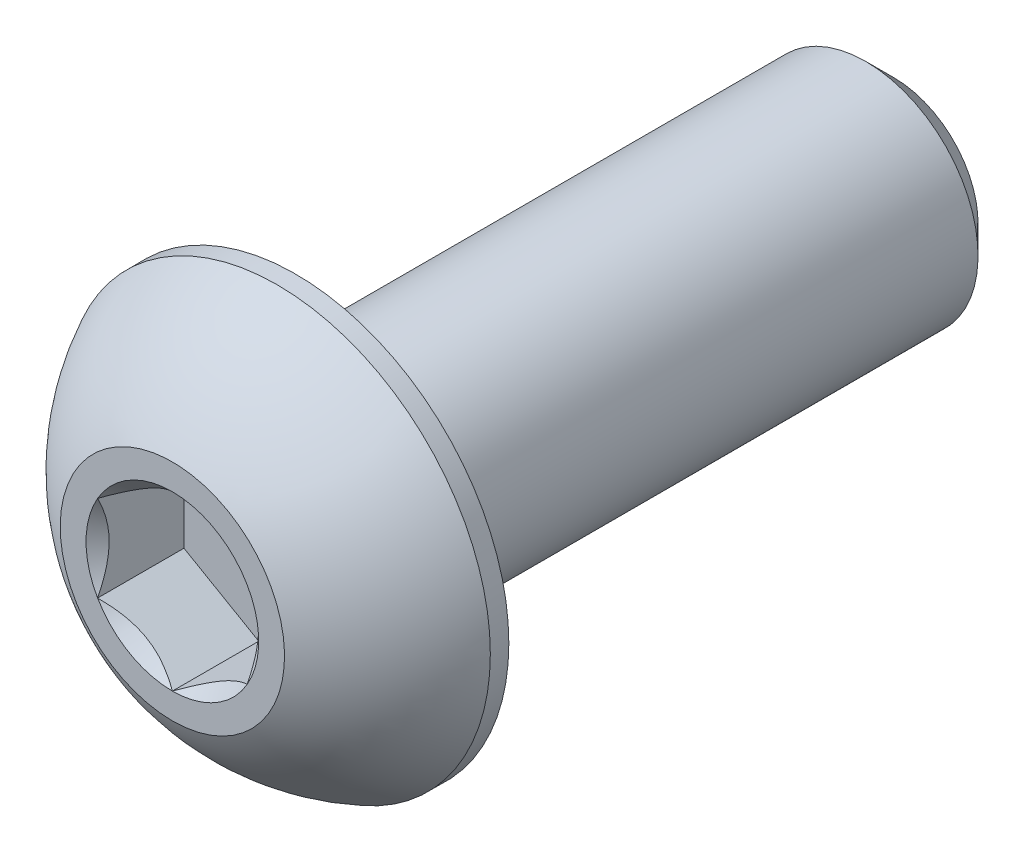
ISO-10303-21;
HEADER;
FILE_DESCRIPTION(('STEP AP214'),'2;1');
FILE_NAME('part.step','',(''),(''),'','','');
FILE_SCHEMA(('AUTOMOTIVE_DESIGN { 1 0 10303 214 1 1 1 1 }'));
ENDSEC;
DATA;
#1=APPLICATION_CONTEXT('core data for automotive mechanical design processes');
#2=APPLICATION_PROTOCOL_DEFINITION('international standard','automotive_design',2000,#1);
#3=PRODUCT_CONTEXT('',#1,'mechanical');
#4=PRODUCT('Part','Part','',(#3));
#5=PRODUCT_RELATED_PRODUCT_CATEGORY('part','',(#4));
#6=PRODUCT_DEFINITION_FORMATION('','',#4);
#7=PRODUCT_DEFINITION_CONTEXT('part definition',#1,'design');
#8=PRODUCT_DEFINITION('design','',#6,#7);
#9=PRODUCT_DEFINITION_SHAPE('','',#8);
#10=(LENGTH_UNIT() NAMED_UNIT(*) SI_UNIT(.MILLI.,.METRE.));
#11=(NAMED_UNIT(*) PLANE_ANGLE_UNIT() SI_UNIT($,.RADIAN.));
#12=(NAMED_UNIT(*) SI_UNIT($,.STERADIAN.) SOLID_ANGLE_UNIT());
#13=UNCERTAINTY_MEASURE_WITH_UNIT(LENGTH_MEASURE(1.E-05),#10,'distance_accuracy_value','');
#14=(GEOMETRIC_REPRESENTATION_CONTEXT(3) GLOBAL_UNCERTAINTY_ASSIGNED_CONTEXT((#13)) GLOBAL_UNIT_ASSIGNED_CONTEXT((#10,
#11,#12)) REPRESENTATION_CONTEXT('',''));
#15=CARTESIAN_POINT('',(0.,0.,0.));
#16=DIRECTION('',(0.,0.,1.));
#17=DIRECTION('',(1.,0.,0.));
#18=AXIS2_PLACEMENT_3D('',#15,#16,#17);
#19=CARTESIAN_POINT('',(0.,-1.5,-9.65));
#20=DIRECTION('',(0.,0.,-1.));
#21=DIRECTION('',(0.,1.,0.));
#22=AXIS2_PLACEMENT_3D('',#19,#20,#21);
#23=PLANE('',#22);
#24=CARTESIAN_POINT('',(0.,0.,-9.65));
#25=DIRECTION('',(0.,0.,-1.));
#26=DIRECTION('',(0.,1.,0.));
#27=AXIS2_PLACEMENT_3D('',#24,#25,#26);
#28=CIRCLE('',#27,1.125);
#29=CARTESIAN_POINT('',(0.,1.125,-9.65));
#30=VERTEX_POINT('',#29);
#31=EDGE_CURVE('E174',#30,#30,#28,.T.);
#32=ORIENTED_EDGE('',*,*,#31,.T.);
#33=EDGE_LOOP('',(#32));
#34=FACE_BOUND('',#33,.T.);
#35=ADVANCED_FACE('F35',(#34),#23,.T.);
#36=CARTESIAN_POINT('',(0.,0.,-9.65));
#37=DIRECTION('',(0.,0.,-1.));
#38=DIRECTION('',(0.,1.,0.));
#39=AXIS2_PLACEMENT_3D('',#36,#37,#38);
#40=CYLINDRICAL_SURFACE('',#39,1.5);
#41=CARTESIAN_POINT('',(0.,0.,-9.275));
#42=DIRECTION('',(0.,0.,-1.));
#43=DIRECTION('',(0.,1.,0.));
#44=AXIS2_PLACEMENT_3D('',#41,#42,#43);
#45=CIRCLE('',#44,1.5);
#46=CARTESIAN_POINT('',(0.,1.5,-9.275));
#47=VERTEX_POINT('',#46);
#48=EDGE_CURVE('E48',#47,#47,#45,.F.);
#49=ORIENTED_EDGE('',*,*,#48,.T.);
#50=EDGE_LOOP('',(#49));
#51=FACE_BOUND('',#50,.T.);
#52=CARTESIAN_POINT('',(0.,0.,-1.65));
#53=DIRECTION('',(0.,0.,1.));
#54=DIRECTION('',(1.,0.,0.));
#55=AXIS2_PLACEMENT_3D('',#52,#53,#54);
#56=CIRCLE('',#55,1.5);
#57=CARTESIAN_POINT('',(1.5,0.,-1.65));
#58=VERTEX_POINT('',#57);
#59=EDGE_CURVE('E171',#58,#58,#56,.F.);
#60=ORIENTED_EDGE('',*,*,#59,.T.);
#61=EDGE_LOOP('',(#60));
#62=FACE_BOUND('',#61,.T.);
#63=ADVANCED_FACE('F179',(#51,#62),#40,.T.);
#64=CARTESIAN_POINT('',(0.,0.,-9.65));
#65=DIRECTION('',(0.,0.,1.));
#66=DIRECTION('',(0.,-1.,0.));
#67=AXIS2_PLACEMENT_3D('',#64,#65,#66);
#68=CONICAL_SURFACE('',#67,1.125,0.785398163397444);
#69=ORIENTED_EDGE('',*,*,#48,.F.);
#70=EDGE_LOOP('',(#69));
#71=FACE_BOUND('',#70,.T.);
#72=ORIENTED_EDGE('',*,*,#31,.F.);
#73=EDGE_LOOP('',(#72));
#74=FACE_BOUND('',#73,.T.);
#75=ADVANCED_FACE('F37',(#71,#74),#68,.T.);
#76=CARTESIAN_POINT('',(0.,0.,-2.79483288770053));
#77=DIRECTION('',(0.,0.,1.));
#78=DIRECTION('',(0.,-1.,0.));
#79=AXIS2_PLACEMENT_3D('',#76,#77,#78);
#80=SPHERICAL_SURFACE('',#79,3.17192226735973);
#81=CARTESIAN_POINT('',(0.,0.,0.));
#82=DIRECTION('',(0.,0.,1.));
#83=DIRECTION('',(1.,0.,0.));
#84=AXIS2_PLACEMENT_3D('',#81,#82,#83);
#85=CIRCLE('',#84,1.5);
#86=CARTESIAN_POINT('',(0.,-1.5,0.));
#87=VERTEX_POINT('',#86);
#88=EDGE_CURVE('E168',#87,#87,#85,.T.);
#89=CARTESIAN_POINT('',(0.,0.,-1.4025));
#90=DIRECTION('',(0.,0.,1.));
#91=DIRECTION('',(1.,0.,0.));
#92=AXIS2_PLACEMENT_3D('',#89,#90,#91);
#93=CIRCLE('',#92,2.85);
#94=CARTESIAN_POINT('',(0.,-2.85,-1.4025));
#95=VERTEX_POINT('',#94);
#96=EDGE_CURVE('E162',#95,#95,#93,.T.);
#97=CARTESIAN_POINT('',(0.,-1.5,0.));
#98=CARTESIAN_POINT('',(0.,-1.5181600798921,-0.00974656947336528));
#99=CARTESIAN_POINT('',(0.,-1.53622513742981,-0.0196701847238475));
#100=CARTESIAN_POINT('',(0.,-1.57215840256594,-0.0398676311293121));
#101=CARTESIAN_POINT('',(0.,-1.59002661016438,-0.0501414622842944));
#102=CARTESIAN_POINT('',(0.,-1.6255593701915,-0.0710354648490241));
#103=CARTESIAN_POINT('',(0.,-1.64322392262019,-0.0816556362587714));
#104=CARTESIAN_POINT('',(0.,-1.67834266450262,-0.103238276426967));
#105=CARTESIAN_POINT('',(0.,-1.69579685395636,-0.114200745185416));
#106=CARTESIAN_POINT('',(0.,-1.73048823664554,-0.136463816635606));
#107=CARTESIAN_POINT('',(0.,-1.74772542988099,-0.147764419327347));
#108=CARTESIAN_POINT('',(0.,-1.78197627078176,-0.170699464187153));
#109=CARTESIAN_POINT('',(0.,-1.79898991844709,-0.182333906355219));
#110=CARTESIAN_POINT('',(0.,-1.83278720341135,-0.205932209546912));
#111=CARTESIAN_POINT('',(0.,-1.84957084071028,-0.21789607057054));
#112=CARTESIAN_POINT('',(0.,-1.88290172764636,-0.242148665498754));
#113=CARTESIAN_POINT('',(0.,-1.89944897728351,-0.254437399403341));
#114=CARTESIAN_POINT('',(0.,-1.93230080139369,-0.279335070725423));
#115=CARTESIAN_POINT('',(0.,-1.94860537586673,-0.291944008142919));
#116=CARTESIAN_POINT('',(0.,-1.98096565436365,-0.317477295441111));
#117=CARTESIAN_POINT('',(0.,-1.99702135838753,-0.330401645321807));
#118=CARTESIAN_POINT('',(0.,-2.02887779526297,-0.356560846652225));
#119=CARTESIAN_POINT('',(0.,-2.04467852811452,-0.369795698101948));
#120=CARTESIAN_POINT('',(0.,-2.07601901880464,-0.396570873693307));
#121=CARTESIAN_POINT('',(0.,-2.09155877664321,-0.410111197834942));
#122=CARTESIAN_POINT('',(0.,-2.12237141262985,-0.437492173862106));
#123=CARTESIAN_POINT('',(0.,-2.13764429077792,-0.451332825747633));
#124=CARTESIAN_POINT('',(0.,-2.16791736411296,-0.479309198198268));
#125=CARTESIAN_POINT('',(0.,-2.18291755929993,-0.493444918763374));
#126=CARTESIAN_POINT('',(0.,-2.21263956705415,-0.52200605739095));
#127=CARTESIAN_POINT('',(0.,-2.22736137962139,-0.536431475453418));
#128=CARTESIAN_POINT('',(0.,-2.2565210282552,-0.56556652781647));
#129=CARTESIAN_POINT('',(0.,-2.27095886432178,-0.580276162117054));
#130=CARTESIAN_POINT('',(0.,-2.2995450739765,-0.609974057702794));
#131=CARTESIAN_POINT('',(0.,-2.31369344756465,-0.624962318987951));
#132=CARTESIAN_POINT('',(0.,-2.34169535627252,-0.655211773418758));
#133=CARTESIAN_POINT('',(0.,-2.35554889139224,-0.670472966564409));
#134=CARTESIAN_POINT('',(0.,-2.38295585920366,-0.701262485885582));
#135=CARTESIAN_POINT('',(0.,-2.39650929189537,-0.716790812061104));
#136=CARTESIAN_POINT('',(0.,-2.42331090492182,-0.748108697108241));
#137=CARTESIAN_POINT('',(0.,-2.43655908525656,-0.763898255979857));
#138=CARTESIAN_POINT('',(0.,-2.46274515962755,-0.795732606824226));
#139=CARTESIAN_POINT('',(0.,-2.47568305366379,-0.811777398796979));
#140=CARTESIAN_POINT('',(0.,-2.50124363939651,-0.844116119267125));
#141=CARTESIAN_POINT('',(0.,-2.51386633109298,-0.860410047764518));
#142=CARTESIAN_POINT('',(0.,-2.53879171587278,-0.893240850042598));
#143=CARTESIAN_POINT('',(0.,-2.55109440895612,-0.909777723823286));
#144=CARTESIAN_POINT('',(0.,-2.57537512182785,-0.943088133113639));
#145=CARTESIAN_POINT('',(0.,-2.58735314161625,-0.959861668623304));
#146=CARTESIAN_POINT('',(0.,-2.61097995657956,-0.993639027894245));
#147=CARTESIAN_POINT('',(0.,-2.62262875175448,-1.01064285165552));
#148=CARTESIAN_POINT('',(0.,-2.64559269128198,-1.04487432644225));
#149=CARTESIAN_POINT('',(0.,-2.65690783563458,-1.06210197746771));
#150=CARTESIAN_POINT('',(0.,-2.67920017403639,-1.09677456077299));
#151=CARTESIAN_POINT('',(0.,-2.69017736808561,-1.11421949305282));
#152=CARTESIAN_POINT('',(0.,-2.711789634999,-1.14932001019995));
#153=CARTESIAN_POINT('',(0.,-2.72242470786316,-1.16697559506725));
#154=CARTESIAN_POINT('',(0.,-2.74334869082118,-1.20249070903942));
#155=CARTESIAN_POINT('',(0.,-2.75363760091502,-1.22035023814429));
#156=CARTESIAN_POINT('',(0.,-2.77386535089241,-1.25626645340824));
#157=CARTESIAN_POINT('',(0.,-2.78380419077596,-1.27432313956732));
#158=CARTESIAN_POINT('',(0.,-2.80332801615778,-1.31062681184411));
#159=CARTESIAN_POINT('',(0.,-2.81291300165605,-1.32887379796182));
#160=CARTESIAN_POINT('',(0.,-2.83172550494215,-1.3655511220839));
#161=CARTESIAN_POINT('',(0.,-2.84095302272998,-1.38398146008827));
#162=CARTESIAN_POINT('',(0.,-2.85,-1.4025));
#163=B_SPLINE_CURVE_WITH_KNOTS('',3,(#97,#98,#99,#100,#101,#102,#103,#104,#105,#106,#107,#108,
#109,#110,#111,#112,#113,#114,#115,#116,#117,#118,#119,#120,#121,#122,#123,#124,#125,#126,#127,
#128,#129,#130,#131,#132,#133,#134,#135,#136,#137,#138,#139,#140,#141,#142,#143,#144,#145,#146,
#147,#148,#149,#150,#151,#152,#153,#154,#155,#156,#157,#158,#159,#160,#161,#162),.UNSPECIFIED.,
.F.,.F.,(4,2,2,2,2,2,2,2,2,2,2,2,2,2,2,2,2,2,2,2,2,2,2,2,2,2,2,2,2,2,2,2,4),(0.,
0.0618298941826979,0.123659788365397,0.185489682548095,0.247319576730792,0.309149470913491,
0.370979365096189,0.432809259278888,0.494639153461586,0.556469047644284,0.618298941826982,
0.68012883600968,0.741958730192378,0.803788624375077,0.865618518557775,0.927448412740473,
0.989278306923171,1.05110820110587,1.11293809528857,1.17476798947127,1.23659788365396,
1.29842777783666,1.36025767201936,1.42208756620206,1.48391746038476,1.54574735456745,
1.60757724875015,1.66940714293285,1.73123703711555,1.79306693129825,1.85489682548095,
1.91672671966364,1.97855661384634),.UNSPECIFIED.);
#164=EDGE_CURVE('BSEAM184',#87,#95,#163,.T.);
#165=ORIENTED_EDGE('',*,*,#88,.F.);
#166=ORIENTED_EDGE('',*,*,#96,.T.);
#167=ORIENTED_EDGE('',*,*,#164,.T.);
#168=ORIENTED_EDGE('',*,*,#164,.F.);
#169=EDGE_LOOP('',(#165,#167,#166,#168));
#170=FACE_BOUND('',#169,.T.);
#171=ADVANCED_FACE('F184',(#170),#80,.T.);
#172=CARTESIAN_POINT('',(0.,-1.5,0.));
#173=DIRECTION('',(0.,0.,-1.));
#174=DIRECTION('',(-1.,0.,0.));
#175=AXIS2_PLACEMENT_3D('',#172,#173,#174);
#176=PLANE('',#175);
#177=CARTESIAN_POINT('',(0.,0.,0.));
#178=DIRECTION('',(0.,0.,1.));
#179=DIRECTION('',(1.,0.,0.));
#180=AXIS2_PLACEMENT_3D('',#177,#178,#179);
#181=CIRCLE('',#180,1.15470053837925);
#182=CARTESIAN_POINT('',(-1.,0.577350269189626,0.));
#183=VERTEX_POINT('',#182);
#184=CARTESIAN_POINT('',(-1.,-0.577350269189626,0.));
#185=VERTEX_POINT('',#184);
#186=EDGE_CURVE('E61',#183,#185,#181,.T.);
#187=ORIENTED_EDGE('',*,*,#186,.F.);
#188=CARTESIAN_POINT('',(0.,1.15470053837925,0.));
#189=VERTEX_POINT('',#188);
#190=EDGE_CURVE('E133',#189,#183,#181,.T.);
#191=ORIENTED_EDGE('',*,*,#190,.F.);
#192=CARTESIAN_POINT('',(1.,0.577350269189626,0.));
#193=VERTEX_POINT('',#192);
#194=EDGE_CURVE('E130',#193,#189,#181,.T.);
#195=ORIENTED_EDGE('',*,*,#194,.F.);
#196=CARTESIAN_POINT('',(1.,-0.577350269189626,0.));
#197=VERTEX_POINT('',#196);
#198=EDGE_CURVE('E101',#197,#193,#181,.T.);
#199=ORIENTED_EDGE('',*,*,#198,.F.);
#200=CARTESIAN_POINT('',(0.,-1.15470053837925,0.));
#201=VERTEX_POINT('',#200);
#202=EDGE_CURVE('E93',#201,#197,#181,.T.);
#203=ORIENTED_EDGE('',*,*,#202,.F.);
#204=EDGE_CURVE('E54',#185,#201,#181,.T.);
#205=ORIENTED_EDGE('',*,*,#204,.F.);
#206=EDGE_LOOP('',(#187,#191,#195,#199,#203,#205));
#207=FACE_BOUND('',#206,.T.);
#208=ORIENTED_EDGE('',*,*,#88,.T.);
#209=EDGE_LOOP('',(#208));
#210=FACE_BOUND('',#209,.T.);
#211=ADVANCED_FACE('F127',(#207,#210),#176,.F.);
#212=CARTESIAN_POINT('',(0.,-2.85,-1.65));
#213=DIRECTION('',(0.,0.,1.));
#214=DIRECTION('',(1.,0.,0.));
#215=AXIS2_PLACEMENT_3D('',#212,#213,#214);
#216=PLANE('',#215);
#217=ORIENTED_EDGE('',*,*,#59,.F.);
#218=EDGE_LOOP('',(#217));
#219=FACE_BOUND('',#218,.T.);
#220=CARTESIAN_POINT('',(0.,0.,-1.65));
#221=DIRECTION('',(0.,0.,1.));
#222=DIRECTION('',(1.,0.,0.));
#223=AXIS2_PLACEMENT_3D('',#220,#221,#222);
#224=CIRCLE('',#223,2.85);
#225=CARTESIAN_POINT('',(2.85,0.,-1.65));
#226=VERTEX_POINT('',#225);
#227=EDGE_CURVE('E165',#226,#226,#224,.T.);
#228=ORIENTED_EDGE('',*,*,#227,.F.);
#229=EDGE_LOOP('',(#228));
#230=FACE_BOUND('',#229,.T.);
#231=ADVANCED_FACE('F198',(#219,#230),#216,.F.);
#232=CARTESIAN_POINT('',(0.,0.,0.));
#233=DIRECTION('',(0.,0.,1.));
#234=DIRECTION('',(1.,0.,0.));
#235=AXIS2_PLACEMENT_3D('',#232,#233,#234);
#236=CYLINDRICAL_SURFACE('',#235,2.85);
#237=ORIENTED_EDGE('',*,*,#96,.F.);
#238=EDGE_LOOP('',(#237));
#239=FACE_BOUND('',#238,.T.);
#240=ORIENTED_EDGE('',*,*,#227,.T.);
#241=EDGE_LOOP('',(#240));
#242=FACE_BOUND('',#241,.T.);
#243=ADVANCED_FACE('F201',(#239,#242),#236,.T.);
#244=CARTESIAN_POINT('',(0.,0.,0.));
#245=DIRECTION('',(0.,0.,1.));
#246=DIRECTION('',(1.,0.,0.));
#247=AXIS2_PLACEMENT_3D('',#244,#245,#246);
#248=CONICAL_SURFACE('',#247,1.15470053837925,0.78539816339745);
#249=ORIENTED_EDGE('',*,*,#198,.T.);
#250=CARTESIAN_POINT('',(1.,-1.15147208646462,0.37038567751386));
#251=CARTESIAN_POINT('',(1.,-1.12343447988552,0.349219919873711));
#252=CARTESIAN_POINT('',(1.,-1.09524064850697,0.328261692175909));
#253=CARTESIAN_POINT('',(1.,-1.03847715644376,0.28684602223562));
#254=CARTESIAN_POINT('',(1.,-1.00990740382975,0.266388706123658));
#255=CARTESIAN_POINT('',(1.,-0.923120894333476,0.205604794954508));
#256=CARTESIAN_POINT('',(1.,-0.864253173759059,0.166192228961397));
#257=CARTESIAN_POINT('',(1.,-0.740809858258045,0.0888206642002041));
#258=CARTESIAN_POINT('',(1.,-0.676100255137807,0.0510730391143413));
#259=CARTESIAN_POINT('',(1.,-0.543448939049124,-0.0179754124487091));
#260=CARTESIAN_POINT('',(1.,-0.475519112027778,-0.0492979721531354));
#261=CARTESIAN_POINT('',(1.,-0.373555850333528,-0.0876182211162059));
#262=CARTESIAN_POINT('',(1.,-0.341031989670907,-0.0986164083578445));
#263=CARTESIAN_POINT('',(1.,-0.275199079052293,-0.11800165785264));
#264=CARTESIAN_POINT('',(1.,-0.241889975173933,-0.126388540223302));
#265=CARTESIAN_POINT('',(1.,-0.175247517042992,-0.139974779280984));
#266=CARTESIAN_POINT('',(1.,-0.141925568218174,-0.145229209232033));
#267=CARTESIAN_POINT('',(1.,-0.0749144362322786,-0.152451313429108));
#268=CARTESIAN_POINT('',(1.,-0.0412251978501615,-0.154418486389493));
#269=CARTESIAN_POINT('',(1.,0.0249580992634212,-0.15491680160684));
#270=CARTESIAN_POINT('',(1.,0.0574512826460394,-0.153569732111366));
#271=CARTESIAN_POINT('',(1.,0.122148505701867,-0.147783515501016));
#272=CARTESIAN_POINT('',(1.,0.154352610132927,-0.143345079338465));
#273=CARTESIAN_POINT('',(1.,0.21879989886764,-0.131543169854797));
#274=CARTESIAN_POINT('',(1.,0.251033743268954,-0.124129458961492));
#275=CARTESIAN_POINT('',(1.,0.314797132354919,-0.106771057501325));
#276=CARTESIAN_POINT('',(1.,0.346326735731005,-0.096826578711171));
#277=CARTESIAN_POINT('',(1.,0.445594187730205,-0.061776517445664));
#278=CARTESIAN_POINT('',(1.,0.511919139476037,-0.0326791416432762));
#279=CARTESIAN_POINT('',(1.,0.641453244657532,0.032015329686504));
#280=CARTESIAN_POINT('',(1.,0.704650133126344,0.0676357767152409));
#281=CARTESIAN_POINT('',(1.,0.825428490174987,0.141123901346934));
#282=CARTESIAN_POINT('',(1.,0.883132947867685,0.178791947135463));
#283=CARTESIAN_POINT('',(1.,0.968148853704565,0.237022852943162));
#284=CARTESIAN_POINT('',(1.,0.996120570380285,0.256638475762855));
#285=CARTESIAN_POINT('',(1.,1.05168177729901,0.29638851706127));
#286=CARTESIAN_POINT('',(1.,1.079271369977,0.316522792198831));
#287=CARTESIAN_POINT('',(1.,1.10670185346329,0.336872119072971));
#288=B_SPLINE_CURVE_WITH_KNOTS('',3,(#250,#251,#252,#253,#254,#255,#256,#257,#258,#259,#260,
#261,#262,#263,#264,#265,#266,#267,#268,#269,#270,#271,#272,#273,#274,#275,#276,#277,#278,#279,
#280,#281,#282,#283,#284,#285,#286,#287),.UNSPECIFIED.,.F.,.F.,(4,2,2,2,2,2,2,2,2,2,2,2,2,2,2,2,
2,2,4),(0.,0.105386459083291,0.210799187330124,0.423233611565468,0.647793540908503,
0.871580877738609,0.97449307418142,1.07741235827201,1.17846428203205,1.27953161415762,
1.3769408673961,1.47432772585408,1.57343322804293,1.67253043972851,1.88917353996827,
2.10660791038813,2.31323734249843,2.41572589232044,2.51818641476503),.UNSPECIFIED.);
#289=EDGE_CURVE('E11',#197,#193,#288,.T.);
#290=ORIENTED_EDGE('',*,*,#289,.F.);
#291=EDGE_LOOP('',(#249,#290));
#292=FACE_BOUND('',#291,.T.);
#293=ADVANCED_FACE('F105',(#292),#248,.F.);
#294=ORIENTED_EDGE('',*,*,#194,.T.);
#295=CARTESIAN_POINT('',(1.0002,0.577234799135788,0.00011548737261379));
#296=CARTESIAN_POINT('',(0.965817404992819,0.597085599618622,-0.0197220691742672));
#297=CARTESIAN_POINT('',(0.930859881860175,0.617268335009457,-0.0383949793611113));
#298=CARTESIAN_POINT('',(0.85957719704391,0.658423412276686,-0.0725852572768423));
#299=CARTESIAN_POINT('',(0.823245249471016,0.67939967198808,-0.0880835909765416));
#300=CARTESIAN_POINT('',(0.749983386196689,0.721697428470847,-0.114632692857735));
#301=CARTESIAN_POINT('',(0.713072148554586,0.743008141459637,-0.125750226003074));
#302=CARTESIAN_POINT('',(0.638437270689141,0.786098608286186,-0.142880134223818));
#303=CARTESIAN_POINT('',(0.600715911891364,0.807877044942281,-0.148905302533328));
#304=CARTESIAN_POINT('',(0.535707801582067,0.845409494928863,-0.154339445032507));
#305=CARTESIAN_POINT('',(0.508505628471828,0.861114676896602,-0.155143061683268));
#306=CARTESIAN_POINT('',(0.454153959330888,0.892494627706029,-0.153793300583113));
#307=CARTESIAN_POINT('',(0.427004476245124,0.908169389073954,-0.151639270452801));
#308=CARTESIAN_POINT('',(0.34594372267304,0.954969836969511,-0.140883027871529));
#309=CARTESIAN_POINT('',(0.292435859021573,0.985862616452447,-0.127985443584644));
#310=CARTESIAN_POINT('',(0.198523934856568,1.04008269114923,-0.0968592693978228));
#311=CARTESIAN_POINT('',(0.157679476328165,1.06366425027551,-0.0802622022981607));
#312=CARTESIAN_POINT('',(0.0775903626180559,1.1099037216352,-0.0428750753147074));
#313=CARTESIAN_POINT('',(0.0383409891295618,1.1325643579843,-0.0220986581825969));
#314=CARTESIAN_POINT('',(-0.000200000000000448,1.15481600843309,0.000115487372613952));
#315=B_SPLINE_CURVE_WITH_KNOTS('',3,(#295,#296,#297,#298,#299,#300,#301,#302,#303,#304,#305,
#306,#307,#308,#309,#310,#311,#312,#313,#314),.UNSPECIFIED.,.F.,.F.,(4,2,2,2,2,2,2,2,2,4),(0.,
0.133237676828559,0.26725222983449,0.3991370762693,0.530689603280768,0.624814864263846,
0.718960890149133,0.907306626112097,1.05710100361789,1.20641411519286),.UNSPECIFIED.);
#316=EDGE_CURVE('E132',#193,#189,#315,.T.);
#317=ORIENTED_EDGE('',*,*,#316,.F.);
#318=EDGE_LOOP('',(#294,#317));
#319=FACE_BOUND('',#318,.T.);
#320=ADVANCED_FACE('F281',(#319),#248,.F.);
#321=ORIENTED_EDGE('',*,*,#190,.T.);
#322=CARTESIAN_POINT('',(0.000199999999999653,1.15481600843309,0.000115487372613877));
#323=CARTESIAN_POINT('',(-0.034182595007181,1.13496520795026,-0.0197220691742673));
#324=CARTESIAN_POINT('',(-0.0691401181398251,1.11478247255942,-0.0383949793611114));
#325=CARTESIAN_POINT('',(-0.14042280295609,1.07362739529219,-0.0725852572768422));
#326=CARTESIAN_POINT('',(-0.176754750528985,1.0526511355808,-0.0880835909765414));
#327=CARTESIAN_POINT('',(-0.250016613803312,1.01035337909803,-0.114632692857735));
#328=CARTESIAN_POINT('',(-0.286927851445415,0.989042666109241,-0.125750226003074));
#329=CARTESIAN_POINT('',(-0.36156272931086,0.945952199282691,-0.142880134223818));
#330=CARTESIAN_POINT('',(-0.399284088108636,0.924173762626596,-0.148905302533328));
#331=CARTESIAN_POINT('',(-0.464292198417934,0.886641312640014,-0.154339445032506));
#332=CARTESIAN_POINT('',(-0.491494371528172,0.870936130672275,-0.155143061683268));
#333=CARTESIAN_POINT('',(-0.545846040669112,0.839556179862848,-0.153793300583113));
#334=CARTESIAN_POINT('',(-0.572995523754876,0.823881418494923,-0.151639270452801));
#335=CARTESIAN_POINT('',(-0.65405627732696,0.777080970599367,-0.140883027871529));
#336=CARTESIAN_POINT('',(-0.707564140978428,0.74618819111643,-0.127985443584644));
#337=CARTESIAN_POINT('',(-0.801476065143432,0.691968116419649,-0.096859269397823));
#338=CARTESIAN_POINT('',(-0.842320523671834,0.668386557293371,-0.0802622022981609));
#339=CARTESIAN_POINT('',(-0.922409637381944,0.622147085933681,-0.0428750753147075));
#340=CARTESIAN_POINT('',(-0.961659010870438,0.599486449584575,-0.0220986581825969));
#341=CARTESIAN_POINT('',(-1.0002,0.577234799135788,0.000115487372613623));
#342=B_SPLINE_CURVE_WITH_KNOTS('',3,(#322,#323,#324,#325,#326,#327,#328,#329,#330,#331,#332,
#333,#334,#335,#336,#337,#338,#339,#340,#341),.UNSPECIFIED.,.F.,.F.,(4,2,2,2,2,2,2,2,2,4),(0.,
0.133237676828559,0.26725222983449,0.3991370762693,0.530689603280768,0.624814864263846,
0.718960890149133,0.907306626112098,1.05710100361789,1.20641411519286),.UNSPECIFIED.);
#343=EDGE_CURVE('E137',#189,#183,#342,.T.);
#344=ORIENTED_EDGE('',*,*,#343,.F.);
#345=EDGE_LOOP('',(#321,#344));
#346=FACE_BOUND('',#345,.T.);
#347=ADVANCED_FACE('F140',(#346),#248,.F.);
#348=ORIENTED_EDGE('',*,*,#186,.T.);
#349=CARTESIAN_POINT('',(-1.,-1.15147208646462,0.370385677513861));
#350=CARTESIAN_POINT('',(-1.,-1.12343447988552,0.349219919873711));
#351=CARTESIAN_POINT('',(-1.,-1.09524064850697,0.328261692175909));
#352=CARTESIAN_POINT('',(-1.,-1.03847715644376,0.286846022235621));
#353=CARTESIAN_POINT('',(-1.,-1.00990740382975,0.266388706123658));
#354=CARTESIAN_POINT('',(-1.,-0.923120894333477,0.205604794954509));
#355=CARTESIAN_POINT('',(-1.,-0.86425317375906,0.166192228961397));
#356=CARTESIAN_POINT('',(-1.,-0.740809858258046,0.0888206642002046));
#357=CARTESIAN_POINT('',(-1.,-0.676100255137807,0.0510730391143418));
#358=CARTESIAN_POINT('',(-1.,-0.543448939049125,-0.0179754124487088));
#359=CARTESIAN_POINT('',(-1.,-0.475519112027779,-0.0492979721531352));
#360=CARTESIAN_POINT('',(-1.,-0.373555850333529,-0.0876182211162059));
#361=CARTESIAN_POINT('',(-1.,-0.341031989670908,-0.0986164083578445));
#362=CARTESIAN_POINT('',(-1.,-0.275199079052293,-0.11800165785264));
#363=CARTESIAN_POINT('',(-1.,-0.241889975173933,-0.126388540223302));
#364=CARTESIAN_POINT('',(-1.,-0.175247517042993,-0.139974779280984));
#365=CARTESIAN_POINT('',(-1.,-0.141925568218175,-0.145229209232033));
#366=CARTESIAN_POINT('',(-1.,-0.074914436232279,-0.152451313429108));
#367=CARTESIAN_POINT('',(-1.,-0.0412251978501618,-0.154418486389493));
#368=CARTESIAN_POINT('',(-1.,0.0249580992634209,-0.15491680160684));
#369=CARTESIAN_POINT('',(-1.,0.0574512826460391,-0.153569732111367));
#370=CARTESIAN_POINT('',(-1.,0.122148505701867,-0.147783515501016));
#371=CARTESIAN_POINT('',(-1.,0.154352610132926,-0.143345079338465));
#372=CARTESIAN_POINT('',(-1.,0.21879989886764,-0.131543169854797));
#373=CARTESIAN_POINT('',(-1.,0.251033743268953,-0.124129458961492));
#374=CARTESIAN_POINT('',(-1.,0.314797132354919,-0.106771057501325));
#375=CARTESIAN_POINT('',(-1.,0.346326735731004,-0.0968265787111712));
#376=CARTESIAN_POINT('',(-1.,0.445594187730205,-0.0617765174456643));
#377=CARTESIAN_POINT('',(-1.,0.511919139476036,-0.0326791416432765));
#378=CARTESIAN_POINT('',(-1.,0.641453244657531,0.0320153296865035));
#379=CARTESIAN_POINT('',(-1.,0.704650133126343,0.0676357767152402));
#380=CARTESIAN_POINT('',(-1.,0.825428490174986,0.141123901346934));
#381=CARTESIAN_POINT('',(-1.,0.883132947867684,0.178791947135462));
#382=CARTESIAN_POINT('',(-1.,0.968148853704564,0.237022852943162));
#383=CARTESIAN_POINT('',(-1.,0.996120570380284,0.256638475762855));
#384=CARTESIAN_POINT('',(-1.,1.05168177729901,0.296388517061269));
#385=CARTESIAN_POINT('',(-1.,1.079271369977,0.31652279219883));
#386=CARTESIAN_POINT('',(-1.,1.10670185346329,0.33687211907297));
#387=B_SPLINE_CURVE_WITH_KNOTS('',3,(#349,#350,#351,#352,#353,#354,#355,#356,#357,#358,#359,
#360,#361,#362,#363,#364,#365,#366,#367,#368,#369,#370,#371,#372,#373,#374,#375,#376,#377,#378,
#379,#380,#381,#382,#383,#384,#385,#386),.UNSPECIFIED.,.F.,.F.,(4,2,2,2,2,2,2,2,2,2,2,2,2,2,2,2,
2,2,4),(0.,0.105386459083291,0.210799187330125,0.423233611565469,0.647793540908503,
0.87158087773861,0.974493074181421,1.07741235827201,1.17846428203205,1.27953161415762,
1.3769408673961,1.47432772585408,1.57343322804293,1.67253043972851,1.88917353996827,
2.10660791038813,2.31323734249843,2.41572589232044,2.51818641476503),.UNSPECIFIED.);
#388=EDGE_CURVE('E144',#183,#185,#387,.F.);
#389=ORIENTED_EDGE('',*,*,#388,.F.);
#390=EDGE_LOOP('',(#348,#389));
#391=FACE_BOUND('',#390,.T.);
#392=ADVANCED_FACE('F275',(#391),#248,.F.);
#393=ORIENTED_EDGE('',*,*,#204,.T.);
#394=CARTESIAN_POINT('',(-1.0002,-0.577234799135788,0.00011548737261379));
#395=CARTESIAN_POINT('',(-0.965817404992819,-0.597085599618622,-0.0197220691742671));
#396=CARTESIAN_POINT('',(-0.930859881860175,-0.617268335009456,-0.0383949793611112));
#397=CARTESIAN_POINT('',(-0.85957719704391,-0.658423412276686,-0.0725852572768422));
#398=CARTESIAN_POINT('',(-0.823245249471016,-0.67939967198808,-0.0880835909765416));
#399=CARTESIAN_POINT('',(-0.749983386196689,-0.721697428470847,-0.114632692857735));
#400=CARTESIAN_POINT('',(-0.713072148554586,-0.743008141459637,-0.125750226003074));
#401=CARTESIAN_POINT('',(-0.638437270689141,-0.786098608286186,-0.142880134223818));
#402=CARTESIAN_POINT('',(-0.600715911891364,-0.807877044942281,-0.148905302533327));
#403=CARTESIAN_POINT('',(-0.535707801582066,-0.845409494928863,-0.154339445032506));
#404=CARTESIAN_POINT('',(-0.508505628471828,-0.861114676896602,-0.155143061683268));
#405=CARTESIAN_POINT('',(-0.454153959330888,-0.892494627706029,-0.153793300583113));
#406=CARTESIAN_POINT('',(-0.427004476245124,-0.908169389073954,-0.151639270452801));
#407=CARTESIAN_POINT('',(-0.34594372267304,-0.954969836969511,-0.140883027871529));
#408=CARTESIAN_POINT('',(-0.292435859021572,-0.985862616452447,-0.127985443584644));
#409=CARTESIAN_POINT('',(-0.198523934856568,-1.04008269114923,-0.0968592693978226));
#410=CARTESIAN_POINT('',(-0.157679476328166,-1.06366425027551,-0.0802622022981606));
#411=CARTESIAN_POINT('',(-0.0775903626180561,-1.1099037216352,-0.0428750753147073));
#412=CARTESIAN_POINT('',(-0.038340989129562,-1.1325643579843,-0.0220986581825967));
#413=CARTESIAN_POINT('',(0.000200000000000127,-1.15481600843309,0.000115487372614116));
#414=B_SPLINE_CURVE_WITH_KNOTS('',3,(#394,#395,#396,#397,#398,#399,#400,#401,#402,#403,#404,
#405,#406,#407,#408,#409,#410,#411,#412,#413),.UNSPECIFIED.,.F.,.F.,(4,2,2,2,2,2,2,2,2,4),(0.,
0.133237676828559,0.26725222983449,0.3991370762693,0.530689603280768,0.624814864263846,
0.718960890149133,0.907306626112098,1.05710100361789,1.20641411519286),.UNSPECIFIED.);
#415=EDGE_CURVE('E117',#185,#201,#414,.T.);
#416=ORIENTED_EDGE('',*,*,#415,.F.);
#417=EDGE_LOOP('',(#393,#416));
#418=FACE_BOUND('',#417,.T.);
#419=ADVANCED_FACE('F226',(#418),#248,.F.);
#420=ORIENTED_EDGE('',*,*,#202,.T.);
#421=CARTESIAN_POINT('',(-0.000199999999999753,-1.15481600843309,0.000115487372614094));
#422=CARTESIAN_POINT('',(0.0341825950071809,-1.13496520795026,-0.019722069174267));
#423=CARTESIAN_POINT('',(0.0691401181398251,-1.11478247255942,-0.0383949793611112));
#424=CARTESIAN_POINT('',(0.14042280295609,-1.07362739529219,-0.0725852572768422));
#425=CARTESIAN_POINT('',(0.176754750528984,-1.0526511355808,-0.0880835909765414));
#426=CARTESIAN_POINT('',(0.250016613803311,-1.01035337909803,-0.114632692857735));
#427=CARTESIAN_POINT('',(0.286927851445415,-0.989042666109241,-0.125750226003074));
#428=CARTESIAN_POINT('',(0.36156272931086,-0.945952199282691,-0.142880134223818));
#429=CARTESIAN_POINT('',(0.399284088108636,-0.924173762626596,-0.148905302533327));
#430=CARTESIAN_POINT('',(0.464292198417934,-0.886641312640014,-0.154339445032506));
#431=CARTESIAN_POINT('',(0.491494371528173,-0.870936130672275,-0.155143061683268));
#432=CARTESIAN_POINT('',(0.545846040669112,-0.839556179862848,-0.153793300583113));
#433=CARTESIAN_POINT('',(0.572995523754876,-0.823881418494923,-0.151639270452801));
#434=CARTESIAN_POINT('',(0.65405627732696,-0.777080970599366,-0.140883027871529));
#435=CARTESIAN_POINT('',(0.707564140978428,-0.74618819111643,-0.127985443584644));
#436=CARTESIAN_POINT('',(0.801476065143432,-0.691968116419649,-0.0968592693978231));
#437=CARTESIAN_POINT('',(0.842320523671835,-0.668386557293371,-0.0802622022981609));
#438=CARTESIAN_POINT('',(0.922409637381944,-0.622147085933681,-0.0428750753147075));
#439=CARTESIAN_POINT('',(0.961659010870438,-0.599486449584575,-0.022098658182597));
#440=CARTESIAN_POINT('',(1.0002,-0.577234799135788,0.000115487372613542));
#441=B_SPLINE_CURVE_WITH_KNOTS('',3,(#421,#422,#423,#424,#425,#426,#427,#428,#429,#430,#431,
#432,#433,#434,#435,#436,#437,#438,#439,#440),.UNSPECIFIED.,.F.,.F.,(4,2,2,2,2,2,2,2,2,4),(0.,
0.133237676828559,0.26725222983449,0.3991370762693,0.530689603280769,0.624814864263847,
0.718960890149133,0.907306626112098,1.05710100361789,1.20641411519286),.UNSPECIFIED.);
#442=EDGE_CURVE('E97',#201,#197,#441,.T.);
#443=ORIENTED_EDGE('',*,*,#442,.F.);
#444=EDGE_LOOP('',(#420,#443));
#445=FACE_BOUND('',#444,.T.);
#446=ADVANCED_FACE('F95',(#445),#248,.F.);
#447=CARTESIAN_POINT('',(1.,-0.577350269189626,-1.155));
#448=DIRECTION('',(0.,0.,1.));
#449=DIRECTION('',(1.,0.,0.));
#450=AXIS2_PLACEMENT_3D('',#447,#448,#449);
#451=PLANE('',#450);
#452=DIRECTION('',(0.866025403784438,0.500000000000001,0.));
#453=VECTOR('',#452,1.);
#454=CARTESIAN_POINT('',(0.,-1.15470053837925,-1.155));
#455=LINE('',#454,#453);
#456=CARTESIAN_POINT('',(0.,-1.15470053837925,-1.155));
#457=VERTEX_POINT('',#456);
#458=CARTESIAN_POINT('',(1.,-0.577350269189626,-1.155));
#459=VERTEX_POINT('',#458);
#460=EDGE_CURVE('E116',#457,#459,#455,.T.);
#461=ORIENTED_EDGE('',*,*,#460,.T.);
#462=DIRECTION('',(0.,1.,0.));
#463=VECTOR('',#462,1.);
#464=CARTESIAN_POINT('',(1.,-0.577350269189626,-1.155));
#465=LINE('',#464,#463);
#466=CARTESIAN_POINT('',(1.,0.577350269189626,-1.155));
#467=VERTEX_POINT('',#466);
#468=EDGE_CURVE('E121',#459,#467,#465,.T.);
#469=ORIENTED_EDGE('',*,*,#468,.T.);
#470=DIRECTION('',(-0.866025403784439,0.5,0.));
#471=VECTOR('',#470,1.);
#472=CARTESIAN_POINT('',(1.,0.577350269189626,-1.155));
#473=LINE('',#472,#471);
#474=CARTESIAN_POINT('',(0.,1.15470053837925,-1.155));
#475=VERTEX_POINT('',#474);
#476=EDGE_CURVE('E265',#467,#475,#473,.T.);
#477=ORIENTED_EDGE('',*,*,#476,.T.);
#478=DIRECTION('',(-0.866025403784438,-0.5,0.));
#479=VECTOR('',#478,1.);
#480=CARTESIAN_POINT('',(0.,1.15470053837925,-1.155));
#481=LINE('',#480,#479);
#482=CARTESIAN_POINT('',(-1.,0.577350269189626,-1.155));
#483=VERTEX_POINT('',#482);
#484=EDGE_CURVE('E153',#475,#483,#481,.T.);
#485=ORIENTED_EDGE('',*,*,#484,.T.);
#486=DIRECTION('',(0.,-1.,0.));
#487=VECTOR('',#486,1.);
#488=CARTESIAN_POINT('',(-1.,0.577350269189626,-1.155));
#489=LINE('',#488,#487);
#490=CARTESIAN_POINT('',(-1.,-0.577350269189626,-1.155));
#491=VERTEX_POINT('',#490);
#492=EDGE_CURVE('E269',#483,#491,#489,.T.);
#493=ORIENTED_EDGE('',*,*,#492,.T.);
#494=DIRECTION('',(0.866025403784439,-0.5,0.));
#495=VECTOR('',#494,1.);
#496=CARTESIAN_POINT('',(-1.,-0.577350269189626,-1.155));
#497=LINE('',#496,#495);
#498=EDGE_CURVE('E124',#491,#457,#497,.T.);
#499=ORIENTED_EDGE('',*,*,#498,.T.);
#500=EDGE_LOOP('',(#461,#469,#477,#485,#493,#499));
#501=FACE_BOUND('',#500,.T.);
#502=ADVANCED_FACE('F225',(#501),#451,.T.);
#503=CARTESIAN_POINT('',(1.,-0.577350269189626,-1.155));
#504=DIRECTION('',(1.,0.,0.));
#505=DIRECTION('',(0.,0.,-1.));
#506=AXIS2_PLACEMENT_3D('',#503,#504,#505);
#507=PLANE('',#506);
#508=DIRECTION('',(0.,0.,1.));
#509=VECTOR('',#508,1.);
#510=CARTESIAN_POINT('',(1.,-0.577350269189626,-1.155));
#511=LINE('',#510,#509);
#512=EDGE_CURVE('E113',#459,#197,#511,.T.);
#513=ORIENTED_EDGE('',*,*,#512,.T.);
#514=ORIENTED_EDGE('',*,*,#289,.T.);
#515=DIRECTION('',(0.,0.,1.));
#516=VECTOR('',#515,1.);
#517=CARTESIAN_POINT('',(1.,0.577350269189626,-1.155));
#518=LINE('',#517,#516);
#519=EDGE_CURVE('E123',#467,#193,#518,.T.);
#520=ORIENTED_EDGE('',*,*,#519,.F.);
#521=ORIENTED_EDGE('',*,*,#468,.F.);
#522=EDGE_LOOP('',(#513,#514,#520,#521));
#523=FACE_BOUND('',#522,.T.);
#524=ADVANCED_FACE('F119',(#523),#507,.F.);
#525=CARTESIAN_POINT('',(1.,0.577350269189626,-1.155));
#526=DIRECTION('',(0.5,0.866025403784439,0.));
#527=DIRECTION('',(-0.866025403784439,0.5,0.));
#528=AXIS2_PLACEMENT_3D('',#525,#526,#527);
#529=PLANE('',#528);
#530=ORIENTED_EDGE('',*,*,#519,.T.);
#531=ORIENTED_EDGE('',*,*,#316,.T.);
#532=DIRECTION('',(0.,0.,1.));
#533=VECTOR('',#532,1.);
#534=CARTESIAN_POINT('',(0.,1.15470053837925,-1.155));
#535=LINE('',#534,#533);
#536=EDGE_CURVE('E149',#475,#189,#535,.T.);
#537=ORIENTED_EDGE('',*,*,#536,.F.);
#538=ORIENTED_EDGE('',*,*,#476,.F.);
#539=EDGE_LOOP('',(#530,#531,#537,#538));
#540=FACE_BOUND('',#539,.T.);
#541=ADVANCED_FACE('F147',(#540),#529,.F.);
#542=CARTESIAN_POINT('',(0.,1.15470053837925,-1.155));
#543=DIRECTION('',(-0.5,0.866025403784438,0.));
#544=DIRECTION('',(-0.866025403784439,-0.5,0.));
#545=AXIS2_PLACEMENT_3D('',#542,#543,#544);
#546=PLANE('',#545);
#547=ORIENTED_EDGE('',*,*,#536,.T.);
#548=ORIENTED_EDGE('',*,*,#343,.T.);
#549=DIRECTION('',(0.,0.,1.));
#550=VECTOR('',#549,1.);
#551=CARTESIAN_POINT('',(-1.,0.577350269189626,-1.155));
#552=LINE('',#551,#550);
#553=EDGE_CURVE('E155',#483,#183,#552,.T.);
#554=ORIENTED_EDGE('',*,*,#553,.F.);
#555=ORIENTED_EDGE('',*,*,#484,.F.);
#556=EDGE_LOOP('',(#547,#548,#554,#555));
#557=FACE_BOUND('',#556,.T.);
#558=ADVANCED_FACE('F151',(#557),#546,.F.);
#559=CARTESIAN_POINT('',(-1.,0.577350269189626,-1.155));
#560=DIRECTION('',(-1.,0.,0.));
#561=DIRECTION('',(0.,0.,1.));
#562=AXIS2_PLACEMENT_3D('',#559,#560,#561);
#563=PLANE('',#562);
#564=ORIENTED_EDGE('',*,*,#553,.T.);
#565=ORIENTED_EDGE('',*,*,#388,.T.);
#566=DIRECTION('',(0.,0.,1.));
#567=VECTOR('',#566,1.);
#568=CARTESIAN_POINT('',(-1.,-0.577350269189626,-1.155));
#569=LINE('',#568,#567);
#570=EDGE_CURVE('E157',#491,#185,#569,.T.);
#571=ORIENTED_EDGE('',*,*,#570,.F.);
#572=ORIENTED_EDGE('',*,*,#492,.F.);
#573=EDGE_LOOP('',(#564,#565,#571,#572));
#574=FACE_BOUND('',#573,.T.);
#575=ADVANCED_FACE('F244',(#574),#563,.F.);
#576=CARTESIAN_POINT('',(-1.,-0.577350269189626,-1.155));
#577=DIRECTION('',(-0.5,-0.866025403784439,0.));
#578=DIRECTION('',(0.866025403784439,-0.5,0.));
#579=AXIS2_PLACEMENT_3D('',#576,#577,#578);
#580=PLANE('',#579);
#581=ORIENTED_EDGE('',*,*,#570,.T.);
#582=ORIENTED_EDGE('',*,*,#415,.T.);
#583=DIRECTION('',(0.,0.,1.));
#584=VECTOR('',#583,1.);
#585=CARTESIAN_POINT('',(0.,-1.15470053837925,-1.155));
#586=LINE('',#585,#584);
#587=EDGE_CURVE('E115',#457,#201,#586,.T.);
#588=ORIENTED_EDGE('',*,*,#587,.F.);
#589=ORIENTED_EDGE('',*,*,#498,.F.);
#590=EDGE_LOOP('',(#581,#582,#588,#589));
#591=FACE_BOUND('',#590,.T.);
#592=ADVANCED_FACE('F208',(#591),#580,.F.);
#593=CARTESIAN_POINT('',(0.,-1.15470053837925,-1.155));
#594=DIRECTION('',(0.500000000000001,-0.866025403784438,0.));
#595=DIRECTION('',(0.866025403784438,0.500000000000001,0.));
#596=AXIS2_PLACEMENT_3D('',#593,#594,#595);
#597=PLANE('',#596);
#598=ORIENTED_EDGE('',*,*,#587,.T.);
#599=ORIENTED_EDGE('',*,*,#442,.T.);
#600=ORIENTED_EDGE('',*,*,#512,.F.);
#601=ORIENTED_EDGE('',*,*,#460,.F.);
#602=EDGE_LOOP('',(#598,#599,#600,#601));
#603=FACE_BOUND('',#602,.T.);
#604=ADVANCED_FACE('F111',(#603),#597,.F.);
#605=CLOSED_SHELL('',(#35,#63,#75,#171,#211,#231,#243,#293,#320,#347,#392,#419,#446,#502,#524,
#541,#558,#575,#592,#604));
#606=MANIFOLD_SOLID_BREP('B2',#605);
#607=ADVANCED_BREP_SHAPE_REPRESENTATION('',(#18,#606),#14);
#608=SHAPE_DEFINITION_REPRESENTATION(#9,#607);
ENDSEC;
END-ISO-10303-21;
